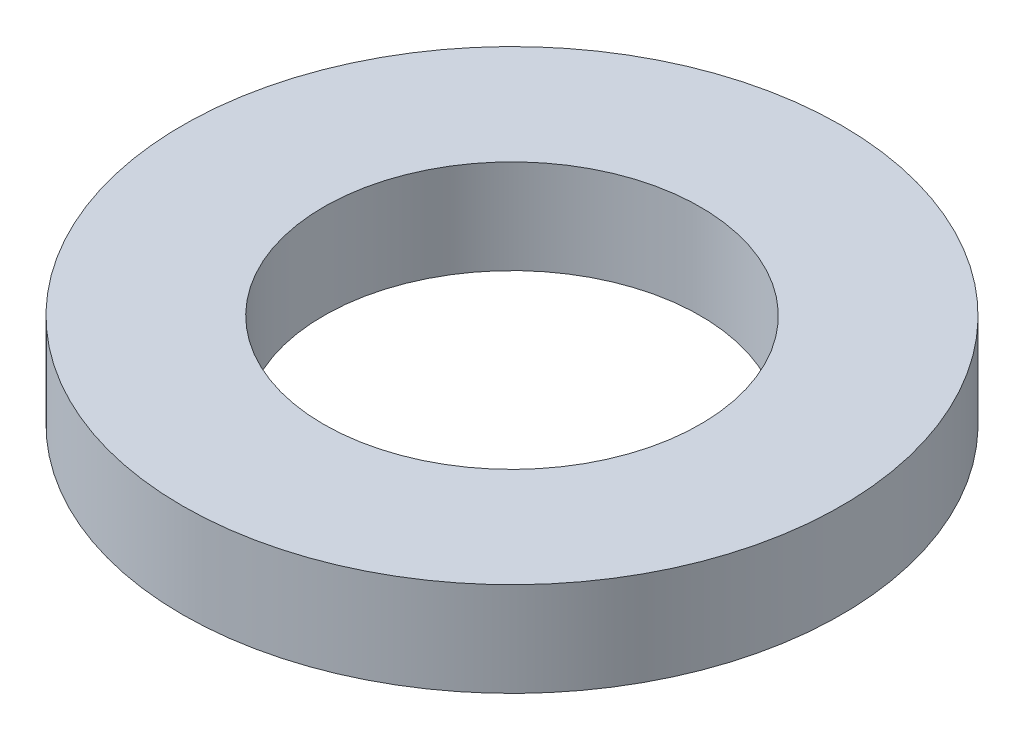
ISO-10303-21;
HEADER;
FILE_DESCRIPTION(('STEP AP214'),'2;1');
FILE_NAME('part.step','',(''),(''),'','','');
FILE_SCHEMA(('AUTOMOTIVE_DESIGN { 1 0 10303 214 1 1 1 1 }'));
ENDSEC;
DATA;
#1=APPLICATION_CONTEXT('core data for automotive mechanical design processes');
#2=APPLICATION_PROTOCOL_DEFINITION('international standard','automotive_design',2000,#1);
#3=PRODUCT_CONTEXT('',#1,'mechanical');
#4=PRODUCT('Part','Part','',(#3));
#5=PRODUCT_RELATED_PRODUCT_CATEGORY('part','',(#4));
#6=PRODUCT_DEFINITION_FORMATION('','',#4);
#7=PRODUCT_DEFINITION_CONTEXT('part definition',#1,'design');
#8=PRODUCT_DEFINITION('design','',#6,#7);
#9=PRODUCT_DEFINITION_SHAPE('','',#8);
#10=(LENGTH_UNIT() NAMED_UNIT(*) SI_UNIT(.MILLI.,.METRE.));
#11=(NAMED_UNIT(*) PLANE_ANGLE_UNIT() SI_UNIT($,.RADIAN.));
#12=(NAMED_UNIT(*) SI_UNIT($,.STERADIAN.) SOLID_ANGLE_UNIT());
#13=UNCERTAINTY_MEASURE_WITH_UNIT(LENGTH_MEASURE(1.E-05),#10,'distance_accuracy_value','');
#14=(GEOMETRIC_REPRESENTATION_CONTEXT(3) GLOBAL_UNCERTAINTY_ASSIGNED_CONTEXT((#13)) GLOBAL_UNIT_ASSIGNED_CONTEXT((#10,
#11,#12)) REPRESENTATION_CONTEXT('',''));
#15=CARTESIAN_POINT('',(0.,0.,0.));
#16=DIRECTION('',(0.,0.,1.));
#17=DIRECTION('',(1.,0.,0.));
#18=AXIS2_PLACEMENT_3D('',#15,#16,#17);
#19=CARTESIAN_POINT('',(0.,2.,0.));
#20=DIRECTION('',(0.,1.,0.));
#21=DIRECTION('',(0.,0.,1.));
#22=AXIS2_PLACEMENT_3D('',#19,#20,#21);
#23=PLANE('',#22);
#24=CARTESIAN_POINT('',(0.,2.,0.));
#25=DIRECTION('',(0.,1.,0.));
#26=DIRECTION('',(0.,0.,1.));
#27=AXIS2_PLACEMENT_3D('',#24,#25,#26);
#28=CIRCLE('',#27,7.);
#29=CARTESIAN_POINT('',(0.,2.,7.));
#30=VERTEX_POINT('',#29);
#31=EDGE_CURVE('E10',#30,#30,#28,.T.);
#32=ORIENTED_EDGE('',*,*,#31,.T.);
#33=EDGE_LOOP('',(#32));
#34=FACE_BOUND('',#33,.T.);
#35=CARTESIAN_POINT('',(0.,2.,0.));
#36=DIRECTION('',(0.,1.,0.));
#37=DIRECTION('',(0.,0.,1.));
#38=AXIS2_PLACEMENT_3D('',#35,#36,#37);
#39=CIRCLE('',#38,4.);
#40=CARTESIAN_POINT('',(0.,2.,4.));
#41=VERTEX_POINT('',#40);
#42=EDGE_CURVE('E44',#41,#41,#39,.T.);
#43=ORIENTED_EDGE('',*,*,#42,.F.);
#44=EDGE_LOOP('',(#43));
#45=FACE_BOUND('',#44,.T.);
#46=ADVANCED_FACE('F33',(#34,#45),#23,.T.);
#47=CARTESIAN_POINT('',(0.,0.,0.));
#48=DIRECTION('',(0.,1.,0.));
#49=DIRECTION('',(0.,0.,1.));
#50=AXIS2_PLACEMENT_3D('',#47,#48,#49);
#51=PLANE('',#50);
#52=CARTESIAN_POINT('',(0.,0.,0.));
#53=DIRECTION('',(0.,1.,0.));
#54=DIRECTION('',(0.,0.,1.));
#55=AXIS2_PLACEMENT_3D('',#52,#53,#54);
#56=CIRCLE('',#55,7.);
#57=CARTESIAN_POINT('',(0.,0.,7.));
#58=VERTEX_POINT('',#57);
#59=EDGE_CURVE('E37',#58,#58,#56,.T.);
#60=ORIENTED_EDGE('',*,*,#59,.F.);
#61=EDGE_LOOP('',(#60));
#62=FACE_BOUND('',#61,.T.);
#63=CARTESIAN_POINT('',(0.,0.,0.));
#64=DIRECTION('',(0.,1.,0.));
#65=DIRECTION('',(0.,0.,1.));
#66=AXIS2_PLACEMENT_3D('',#63,#64,#65);
#67=CIRCLE('',#66,4.);
#68=CARTESIAN_POINT('',(0.,0.,4.));
#69=VERTEX_POINT('',#68);
#70=EDGE_CURVE('E46',#69,#69,#67,.T.);
#71=ORIENTED_EDGE('',*,*,#70,.T.);
#72=EDGE_LOOP('',(#71));
#73=FACE_BOUND('',#72,.T.);
#74=ADVANCED_FACE('F56',(#62,#73),#51,.F.);
#75=CARTESIAN_POINT('',(0.,2.,0.));
#76=DIRECTION('',(0.,-1.,0.));
#77=DIRECTION('',(0.,0.,-1.));
#78=AXIS2_PLACEMENT_3D('',#75,#76,#77);
#79=CYLINDRICAL_SURFACE('',#78,7.);
#80=ORIENTED_EDGE('',*,*,#31,.F.);
#81=EDGE_LOOP('',(#80));
#82=FACE_BOUND('',#81,.T.);
#83=ORIENTED_EDGE('',*,*,#59,.T.);
#84=EDGE_LOOP('',(#83));
#85=FACE_BOUND('',#84,.T.);
#86=ADVANCED_FACE('F35',(#82,#85),#79,.T.);
#87=CARTESIAN_POINT('',(0.,2.,0.));
#88=DIRECTION('',(0.,-1.,0.));
#89=DIRECTION('',(0.,0.,-1.));
#90=AXIS2_PLACEMENT_3D('',#87,#88,#89);
#91=CYLINDRICAL_SURFACE('',#90,4.);
#92=ORIENTED_EDGE('',*,*,#42,.T.);
#93=EDGE_LOOP('',(#92));
#94=FACE_BOUND('',#93,.T.);
#95=ORIENTED_EDGE('',*,*,#70,.F.);
#96=EDGE_LOOP('',(#95));
#97=FACE_BOUND('',#96,.T.);
#98=ADVANCED_FACE('F52',(#94,#97),#91,.F.);
#99=CLOSED_SHELL('',(#46,#74,#86,#98));
#100=MANIFOLD_SOLID_BREP('B2',#99);
#101=ADVANCED_BREP_SHAPE_REPRESENTATION('',(#18,#100),#14);
#102=SHAPE_DEFINITION_REPRESENTATION(#9,#101);
ENDSEC;
END-ISO-10303-21;
